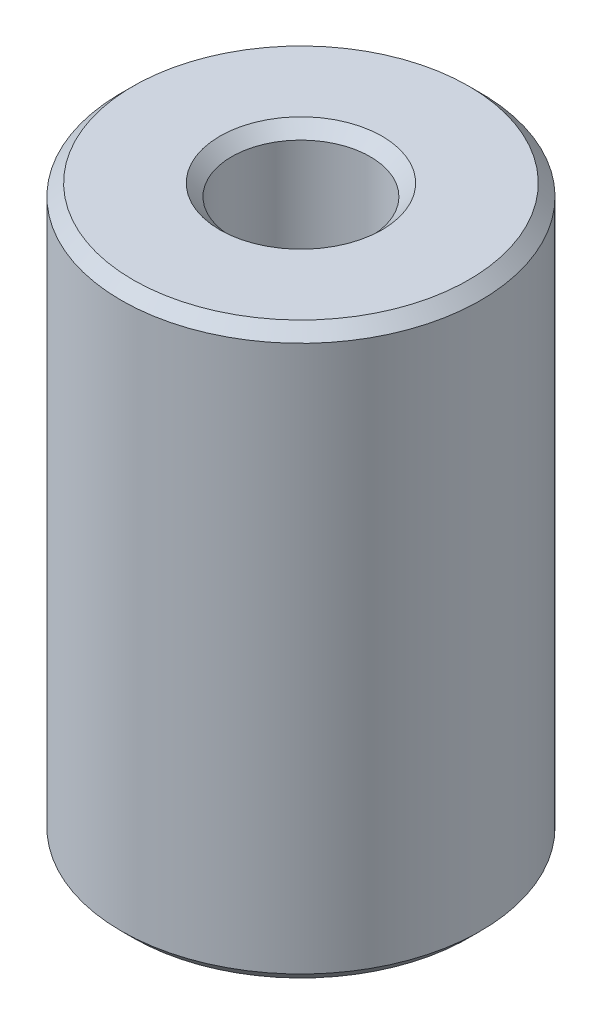
ISO-10303-21;
HEADER;
FILE_DESCRIPTION(('STEP AP214'),'2;1');
FILE_NAME('part.step','',(''),(''),'','','');
FILE_SCHEMA(('AUTOMOTIVE_DESIGN { 1 0 10303 214 1 1 1 1 }'));
ENDSEC;
DATA;
#1=APPLICATION_CONTEXT('core data for automotive mechanical design processes');
#2=APPLICATION_PROTOCOL_DEFINITION('international standard','automotive_design',2000,#1);
#3=PRODUCT_CONTEXT('',#1,'mechanical');
#4=PRODUCT('Part','Part','',(#3));
#5=PRODUCT_RELATED_PRODUCT_CATEGORY('part','',(#4));
#6=PRODUCT_DEFINITION_FORMATION('','',#4);
#7=PRODUCT_DEFINITION_CONTEXT('part definition',#1,'design');
#8=PRODUCT_DEFINITION('design','',#6,#7);
#9=PRODUCT_DEFINITION_SHAPE('','',#8);
#10=(LENGTH_UNIT() NAMED_UNIT(*) SI_UNIT(.MILLI.,.METRE.));
#11=(NAMED_UNIT(*) PLANE_ANGLE_UNIT() SI_UNIT($,.RADIAN.));
#12=(NAMED_UNIT(*) SI_UNIT($,.STERADIAN.) SOLID_ANGLE_UNIT());
#13=UNCERTAINTY_MEASURE_WITH_UNIT(LENGTH_MEASURE(1.E-05),#10,'distance_accuracy_value','');
#14=(GEOMETRIC_REPRESENTATION_CONTEXT(3) GLOBAL_UNCERTAINTY_ASSIGNED_CONTEXT((#13)) GLOBAL_UNIT_ASSIGNED_CONTEXT((#10,
#11,#12)) REPRESENTATION_CONTEXT('',''));
#15=CARTESIAN_POINT('',(0.,0.,0.));
#16=DIRECTION('',(0.,0.,1.));
#17=DIRECTION('',(1.,0.,0.));
#18=AXIS2_PLACEMENT_3D('',#15,#16,#17);
#19=CARTESIAN_POINT('',(0.,174.444310482127,0.));
#20=DIRECTION('',(0.,-1.,0.));
#21=DIRECTION('',(0.,0.,-1.));
#22=AXIS2_PLACEMENT_3D('',#19,#20,#21);
#23=CYLINDRICAL_SURFACE('',#22,55.);
#24=CARTESIAN_POINT('',(0.,3.61828616880588,0.));
#25=DIRECTION('',(0.,1.,0.));
#26=DIRECTION('',(0.,0.,1.));
#27=AXIS2_PLACEMENT_3D('',#24,#25,#26);
#28=CIRCLE('',#27,55.);
#29=CARTESIAN_POINT('',(0.,3.61828616880588,55.));
#30=VERTEX_POINT('',#29);
#31=EDGE_CURVE('E10',#30,#30,#28,.T.);
#32=ORIENTED_EDGE('',*,*,#31,.T.);
#33=EDGE_LOOP('',(#32));
#34=FACE_BOUND('',#33,.T.);
#35=CARTESIAN_POINT('',(0.,170.826024313321,0.));
#36=DIRECTION('',(0.,1.,0.));
#37=DIRECTION('',(0.,0.,1.));
#38=AXIS2_PLACEMENT_3D('',#35,#36,#37);
#39=CIRCLE('',#38,55.);
#40=CARTESIAN_POINT('',(0.,170.826024313321,55.));
#41=VERTEX_POINT('',#40);
#42=EDGE_CURVE('E50',#41,#41,#39,.F.);
#43=ORIENTED_EDGE('',*,*,#42,.T.);
#44=EDGE_LOOP('',(#43));
#45=FACE_BOUND('',#44,.T.);
#46=ADVANCED_FACE('F39',(#34,#45),#23,.T.);
#47=CARTESIAN_POINT('',(0.,174.444310482127,0.));
#48=DIRECTION('',(0.,1.,0.));
#49=DIRECTION('',(0.,0.,1.));
#50=AXIS2_PLACEMENT_3D('',#47,#48,#49);
#51=PLANE('',#50);
#52=CARTESIAN_POINT('',(0.,174.444310482127,0.));
#53=DIRECTION('',(0.,1.,0.));
#54=DIRECTION('',(0.,0.,1.));
#55=AXIS2_PLACEMENT_3D('',#52,#53,#54);
#56=CIRCLE('',#55,24.8393216338691);
#57=CARTESIAN_POINT('',(0.,174.444310482127,24.8393216338691));
#58=VERTEX_POINT('',#57);
#59=EDGE_CURVE('E58',#58,#58,#56,.F.);
#60=ORIENTED_EDGE('',*,*,#59,.T.);
#61=EDGE_LOOP('',(#60));
#62=FACE_BOUND('',#61,.T.);
#63=CARTESIAN_POINT('',(0.,174.444310482127,0.));
#64=DIRECTION('',(0.,1.,0.));
#65=DIRECTION('',(0.,0.,1.));
#66=AXIS2_PLACEMENT_3D('',#63,#64,#65);
#67=CIRCLE('',#66,51.3817138311941);
#68=CARTESIAN_POINT('',(0.,174.444310482127,51.3817138311941));
#69=VERTEX_POINT('',#68);
#70=EDGE_CURVE('E61',#69,#69,#67,.T.);
#71=ORIENTED_EDGE('',*,*,#70,.T.);
#72=EDGE_LOOP('',(#71));
#73=FACE_BOUND('',#72,.T.);
#74=ADVANCED_FACE('F88',(#62,#73),#51,.T.);
#75=CARTESIAN_POINT('',(0.,0.,0.));
#76=DIRECTION('',(0.,1.,0.));
#77=DIRECTION('',(0.,0.,1.));
#78=AXIS2_PLACEMENT_3D('',#75,#76,#77);
#79=PLANE('',#78);
#80=CARTESIAN_POINT('',(0.,0.,0.));
#81=DIRECTION('',(0.,1.,0.));
#82=DIRECTION('',(0.,0.,1.));
#83=AXIS2_PLACEMENT_3D('',#80,#81,#82);
#84=CIRCLE('',#83,24.8393216338691);
#85=CARTESIAN_POINT('',(0.,0.,24.8393216338691));
#86=VERTEX_POINT('',#85);
#87=EDGE_CURVE('E51',#86,#86,#84,.T.);
#88=ORIENTED_EDGE('',*,*,#87,.T.);
#89=EDGE_LOOP('',(#88));
#90=FACE_BOUND('',#89,.T.);
#91=CARTESIAN_POINT('',(0.,0.,0.));
#92=DIRECTION('',(0.,1.,0.));
#93=DIRECTION('',(0.,0.,1.));
#94=AXIS2_PLACEMENT_3D('',#91,#92,#93);
#95=CIRCLE('',#94,51.3817138311941);
#96=CARTESIAN_POINT('',(0.,0.,51.3817138311941));
#97=VERTEX_POINT('',#96);
#98=EDGE_CURVE('E54',#97,#97,#95,.F.);
#99=ORIENTED_EDGE('',*,*,#98,.T.);
#100=EDGE_LOOP('',(#99));
#101=FACE_BOUND('',#100,.T.);
#102=ADVANCED_FACE('F83',(#90,#101),#79,.F.);
#103=CARTESIAN_POINT('',(0.,174.444310482127,0.));
#104=DIRECTION('',(0.,-1.,0.));
#105=DIRECTION('',(0.,0.,-1.));
#106=AXIS2_PLACEMENT_3D('',#103,#104,#105);
#107=CYLINDRICAL_SURFACE('',#106,21.2210354650632);
#108=CARTESIAN_POINT('',(0.,170.826024313321,0.));
#109=DIRECTION('',(0.,1.,0.));
#110=DIRECTION('',(0.,0.,1.));
#111=AXIS2_PLACEMENT_3D('',#108,#109,#110);
#112=CIRCLE('',#111,21.2210354650632);
#113=CARTESIAN_POINT('',(0.,170.826024313321,21.2210354650632));
#114=VERTEX_POINT('',#113);
#115=EDGE_CURVE('E67',#114,#114,#112,.T.);
#116=ORIENTED_EDGE('',*,*,#115,.T.);
#117=EDGE_LOOP('',(#116));
#118=FACE_BOUND('',#117,.T.);
#119=CARTESIAN_POINT('',(0.,3.61828616880591,0.));
#120=DIRECTION('',(0.,1.,0.));
#121=DIRECTION('',(0.,0.,1.));
#122=AXIS2_PLACEMENT_3D('',#119,#120,#121);
#123=CIRCLE('',#122,21.2210354650632);
#124=CARTESIAN_POINT('',(0.,3.61828616880591,21.2210354650632));
#125=VERTEX_POINT('',#124);
#126=EDGE_CURVE('E69',#125,#125,#123,.F.);
#127=ORIENTED_EDGE('',*,*,#126,.T.);
#128=EDGE_LOOP('',(#127));
#129=FACE_BOUND('',#128,.T.);
#130=ADVANCED_FACE('F71',(#118,#129),#107,.F.);
#131=CARTESIAN_POINT('',(0.,170.826024313321,0.));
#132=DIRECTION('',(0.,1.,0.));
#133=DIRECTION('',(0.,0.,1.));
#134=AXIS2_PLACEMENT_3D('',#131,#132,#133);
#135=CONICAL_SURFACE('',#134,21.2210354650632,0.785398163397449);
#136=ORIENTED_EDGE('',*,*,#59,.F.);
#137=EDGE_LOOP('',(#136));
#138=FACE_BOUND('',#137,.T.);
#139=ORIENTED_EDGE('',*,*,#115,.F.);
#140=EDGE_LOOP('',(#139));
#141=FACE_BOUND('',#140,.T.);
#142=ADVANCED_FACE('F77',(#138,#141),#135,.F.);
#143=CARTESIAN_POINT('',(0.,0.,0.));
#144=DIRECTION('',(0.,-1.,0.));
#145=DIRECTION('',(0.,0.,-1.));
#146=AXIS2_PLACEMENT_3D('',#143,#144,#145);
#147=CONICAL_SURFACE('',#146,24.8393216338691,0.785398163397442);
#148=ORIENTED_EDGE('',*,*,#126,.F.);
#149=EDGE_LOOP('',(#148));
#150=FACE_BOUND('',#149,.T.);
#151=ORIENTED_EDGE('',*,*,#87,.F.);
#152=EDGE_LOOP('',(#151));
#153=FACE_BOUND('',#152,.T.);
#154=ADVANCED_FACE('F73',(#150,#153),#147,.F.);
#155=CARTESIAN_POINT('',(0.,3.61828616880588,0.));
#156=DIRECTION('',(0.,1.,0.));
#157=DIRECTION('',(0.,0.,1.));
#158=AXIS2_PLACEMENT_3D('',#155,#156,#157);
#159=CONICAL_SURFACE('',#158,55.,0.785398163397453);
#160=CARTESIAN_POINT('',(0.,0.,51.3817138311941));
#161=CARTESIAN_POINT('',(0.,0.0376904809250607,51.4194043121191));
#162=CARTESIAN_POINT('',(0.,0.0753809618501221,51.4570947930442));
#163=CARTESIAN_POINT('',(0.,0.150761923700245,51.5324757548943));
#164=CARTESIAN_POINT('',(0.,0.188452404625306,51.5701662358194));
#165=CARTESIAN_POINT('',(0.,0.263833366475429,51.6455471976695));
#166=CARTESIAN_POINT('',(0.,0.30152384740049,51.6832376785946));
#167=CARTESIAN_POINT('',(0.,0.376904809250613,51.7586186404447));
#168=CARTESIAN_POINT('',(0.,0.414595290175675,51.7963091213698));
#169=CARTESIAN_POINT('',(0.,0.489976252025797,51.8716900832199));
#170=CARTESIAN_POINT('',(0.,0.527666732950857,51.9093805641449));
#171=CARTESIAN_POINT('',(0.,0.60304769480098,51.9847615259951));
#172=CARTESIAN_POINT('',(0.,0.640738175726041,52.0224520069201));
#173=CARTESIAN_POINT('',(0.,0.716119137576164,52.0978329687703));
#174=CARTESIAN_POINT('',(0.,0.753809618501226,52.1355234496953));
#175=CARTESIAN_POINT('',(0.,0.829190580351348,52.2109044115454));
#176=CARTESIAN_POINT('',(0.,0.866881061276409,52.2485948924705));
#177=CARTESIAN_POINT('',(0.,0.942262023126532,52.3239758543206));
#178=CARTESIAN_POINT('',(0.,0.979952504051593,52.3616663352457));
#179=CARTESIAN_POINT('',(0.,1.05533346590172,52.4370472970958));
#180=CARTESIAN_POINT('',(0.,1.09302394682678,52.4747377780209));
#181=CARTESIAN_POINT('',(0.,1.1684049086769,52.550118739871));
#182=CARTESIAN_POINT('',(0.,1.20609538960196,52.5878092207961));
#183=CARTESIAN_POINT('',(0.,1.28147635145208,52.6631901826462));
#184=CARTESIAN_POINT('',(0.,1.31916683237715,52.7008806635712));
#185=CARTESIAN_POINT('',(0.,1.39454779422727,52.7762616254214));
#186=CARTESIAN_POINT('',(0.,1.43223827515233,52.8139521063464));
#187=CARTESIAN_POINT('',(0.,1.50761923700245,52.8893330681965));
#188=CARTESIAN_POINT('',(0.,1.54530971792751,52.9270235491216));
#189=CARTESIAN_POINT('',(0.,1.62069067977764,53.0024045109717));
#190=CARTESIAN_POINT('',(0.,1.6583811607027,53.0400949918968));
#191=CARTESIAN_POINT('',(0.,1.73376212255282,53.1154759537469));
#192=CARTESIAN_POINT('',(0.,1.77145260347788,53.153166434672));
#193=CARTESIAN_POINT('',(0.,1.846833565328,53.2285473965221));
#194=CARTESIAN_POINT('',(0.,1.88452404625306,53.2662378774472));
#195=CARTESIAN_POINT('',(0.,1.95990500810319,53.3416188392973));
#196=CARTESIAN_POINT('',(0.,1.99759548902825,53.3793093202223));
#197=CARTESIAN_POINT('',(0.,2.07297645087837,53.4546902820725));
#198=CARTESIAN_POINT('',(0.,2.11066693180343,53.4923807629975));
#199=CARTESIAN_POINT('',(0.,2.18604789365356,53.5677617248477));
#200=CARTESIAN_POINT('',(0.,2.22373837457862,53.6054522057727));
#201=CARTESIAN_POINT('',(0.,2.29911933642874,53.6808331676228));
#202=CARTESIAN_POINT('',(0.,2.3368098173538,53.7185236485479));
#203=CARTESIAN_POINT('',(0.,2.41219077920392,53.793904610398));
#204=CARTESIAN_POINT('',(0.,2.44988126012898,53.8315950913231));
#205=CARTESIAN_POINT('',(0.,2.52526222197911,53.9069760531732));
#206=CARTESIAN_POINT('',(0.,2.56295270290417,53.9446665340983));
#207=CARTESIAN_POINT('',(0.,2.63833366475429,54.0200474959484));
#208=CARTESIAN_POINT('',(0.,2.67602414567935,54.0577379768735));
#209=CARTESIAN_POINT('',(0.,2.75140510752947,54.1331189387236));
#210=CARTESIAN_POINT('',(0.,2.78909558845454,54.1708094196486));
#211=CARTESIAN_POINT('',(0.,2.86447655030466,54.2461903814988));
#212=CARTESIAN_POINT('',(0.,2.90216703122972,54.2838808624238));
#213=CARTESIAN_POINT('',(0.,2.97754799307984,54.359261824274));
#214=CARTESIAN_POINT('',(0.,3.0152384740049,54.396952305199));
#215=CARTESIAN_POINT('',(0.,3.09061943585503,54.4723332670491));
#216=CARTESIAN_POINT('',(0.,3.12830991678009,54.5100237479742));
#217=CARTESIAN_POINT('',(0.,3.20369087863021,54.5854047098243));
#218=CARTESIAN_POINT('',(0.,3.24138135955527,54.6230951907494));
#219=CARTESIAN_POINT('',(0.,3.31676232140539,54.6984761525995));
#220=CARTESIAN_POINT('',(0.,3.35445280233046,54.7361666335246));
#221=CARTESIAN_POINT('',(0.,3.42983376418058,54.8115475953747));
#222=CARTESIAN_POINT('',(0.,3.46752424510564,54.8492380762998));
#223=CARTESIAN_POINT('',(0.,3.54290520695576,54.9246190381499));
#224=CARTESIAN_POINT('',(0.,3.58059568788082,54.9623095190749));
#225=CARTESIAN_POINT('',(0.,3.61828616880588,55.));
#226=B_SPLINE_CURVE_WITH_KNOTS('',3,(#160,#161,#162,#163,#164,#165,#166,#167,#168,#169,#170,
#171,#172,#173,#174,#175,#176,#177,#178,#179,#180,#181,#182,#183,#184,#185,#186,#187,#188,#189,
#190,#191,#192,#193,#194,#195,#196,#197,#198,#199,#200,#201,#202,#203,#204,#205,#206,#207,#208,
#209,#210,#211,#212,#213,#214,#215,#216,#217,#218,#219,#220,#221,#222,#223,#224,#225),
.UNSPECIFIED.,.F.,.F.,(4,2,2,2,2,2,2,2,2,2,2,2,2,2,2,2,2,2,2,2,2,2,2,2,2,2,2,2,2,2,2,2,4),(0.,
0.159907167889758,0.319814335779517,0.479721503669275,0.639628671559033,0.799535839448797,
0.959443007338555,1.11935017522831,1.27925734311807,1.43916451100783,1.59907167889759,
1.75897884678735,1.91888601467711,2.07879318256687,2.23870035045663,2.39860751834639,
2.55851468623614,2.71842185412591,2.87832902201567,3.03823618990542,3.19814335779518,
3.35805052568494,3.5179576935747,3.67786486146446,3.83777202935422,3.99767919724398,
4.15758636513374,4.3174935330235,4.47740070091325,4.63730786880302,4.79721503669278,
4.95712220458253,5.11702937247229),.UNSPECIFIED.);
#227=EDGE_CURVE('BSEAM76',#97,#30,#226,.T.);
#228=ORIENTED_EDGE('',*,*,#98,.F.);
#229=ORIENTED_EDGE('',*,*,#31,.F.);
#230=ORIENTED_EDGE('',*,*,#227,.T.);
#231=ORIENTED_EDGE('',*,*,#227,.F.);
#232=EDGE_LOOP('',(#228,#230,#229,#231));
#233=FACE_BOUND('',#232,.T.);
#234=ADVANCED_FACE('F76',(#233),#159,.T.);
#235=CARTESIAN_POINT('',(0.,174.444310482127,0.));
#236=DIRECTION('',(0.,-1.,0.));
#237=DIRECTION('',(0.,0.,-1.));
#238=AXIS2_PLACEMENT_3D('',#235,#236,#237);
#239=CONICAL_SURFACE('',#238,51.3817138311941,0.785398163397446);
#240=ORIENTED_EDGE('',*,*,#42,.F.);
#241=EDGE_LOOP('',(#240));
#242=FACE_BOUND('',#241,.T.);
#243=ORIENTED_EDGE('',*,*,#70,.F.);
#244=EDGE_LOOP('',(#243));
#245=FACE_BOUND('',#244,.T.);
#246=ADVANCED_FACE('F45',(#242,#245),#239,.T.);
#247=CLOSED_SHELL('',(#46,#74,#102,#130,#142,#154,#234,#246));
#248=MANIFOLD_SOLID_BREP('B2',#247);
#249=ADVANCED_BREP_SHAPE_REPRESENTATION('',(#18,#248),#14);
#250=SHAPE_DEFINITION_REPRESENTATION(#9,#249);
ENDSEC;
END-ISO-10303-21;
